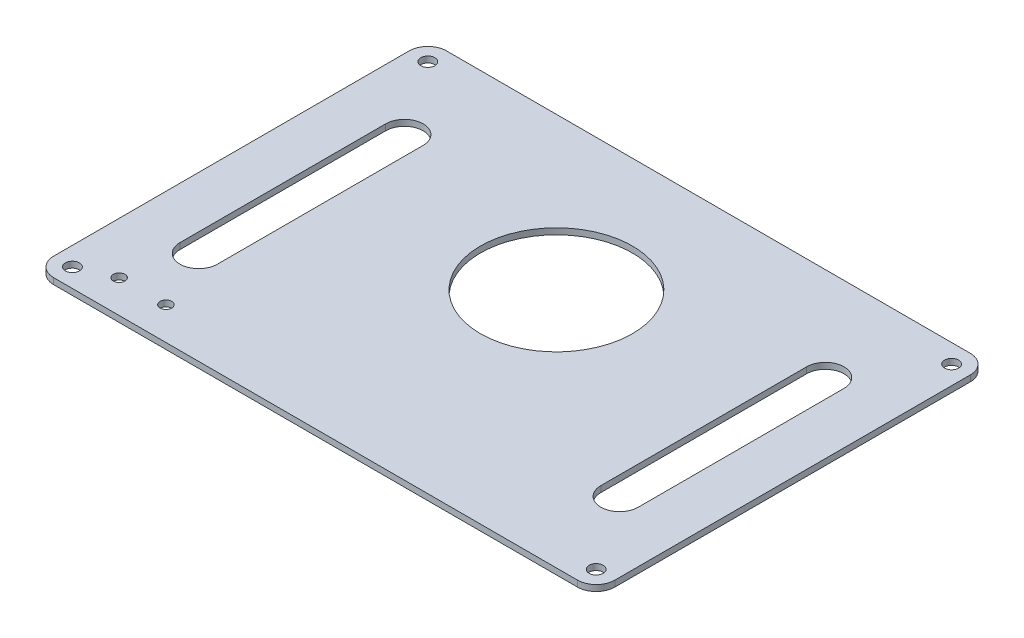
ISO-10303-21;
HEADER;
FILE_DESCRIPTION(('STEP AP214'),'2;1');
FILE_NAME('part.step','',(''),(''),'','','');
FILE_SCHEMA(('AUTOMOTIVE_DESIGN { 1 0 10303 214 1 1 1 1 }'));
ENDSEC;
DATA;
#1=APPLICATION_CONTEXT('core data for automotive mechanical design processes');
#2=APPLICATION_PROTOCOL_DEFINITION('international standard','automotive_design',2000,#1);
#3=PRODUCT_CONTEXT('',#1,'mechanical');
#4=PRODUCT('Part','Part','',(#3));
#5=PRODUCT_RELATED_PRODUCT_CATEGORY('part','',(#4));
#6=PRODUCT_DEFINITION_FORMATION('','',#4);
#7=PRODUCT_DEFINITION_CONTEXT('part definition',#1,'design');
#8=PRODUCT_DEFINITION('design','',#6,#7);
#9=PRODUCT_DEFINITION_SHAPE('','',#8);
#10=(LENGTH_UNIT() NAMED_UNIT(*) SI_UNIT(.MILLI.,.METRE.));
#11=(NAMED_UNIT(*) PLANE_ANGLE_UNIT() SI_UNIT($,.RADIAN.));
#12=(NAMED_UNIT(*) SI_UNIT($,.STERADIAN.) SOLID_ANGLE_UNIT());
#13=UNCERTAINTY_MEASURE_WITH_UNIT(LENGTH_MEASURE(1.E-05),#10,'distance_accuracy_value','');
#14=(GEOMETRIC_REPRESENTATION_CONTEXT(3) GLOBAL_UNCERTAINTY_ASSIGNED_CONTEXT((#13)) GLOBAL_UNIT_ASSIGNED_CONTEXT((#10,
#11,#12)) REPRESENTATION_CONTEXT('',''));
#15=CARTESIAN_POINT('',(0.,0.,0.));
#16=DIRECTION('',(0.,0.,1.));
#17=DIRECTION('',(1.,0.,0.));
#18=AXIS2_PLACEMENT_3D('',#15,#16,#17);
#19=CARTESIAN_POINT('',(56.0000000000008,1.3,38.));
#20=DIRECTION('',(0.,1.,0.));
#21=DIRECTION('',(0.,0.,1.));
#22=AXIS2_PLACEMENT_3D('',#19,#20,#21);
#23=PLANE('',#22);
#24=CARTESIAN_POINT('',(-39.,1.3,35.0000000000004));
#25=DIRECTION('',(0.,1.,0.));
#26=DIRECTION('',(0.,0.,1.));
#27=AXIS2_PLACEMENT_3D('',#24,#25,#26);
#28=CIRCLE('',#27,1.25);
#29=CARTESIAN_POINT('',(-39.,1.3,36.2500000000004));
#30=VERTEX_POINT('',#29);
#31=EDGE_CURVE('E258',#30,#30,#28,.T.);
#32=ORIENTED_EDGE('',*,*,#31,.F.);
#33=EDGE_LOOP('',(#32));
#34=FACE_BOUND('',#33,.T.);
#35=CARTESIAN_POINT('',(-49.,1.3,35.0000000000004));
#36=DIRECTION('',(0.,1.,0.));
#37=DIRECTION('',(0.,0.,1.));
#38=AXIS2_PLACEMENT_3D('',#35,#36,#37);
#39=CIRCLE('',#38,1.25);
#40=CARTESIAN_POINT('',(-49.,1.3,36.2500000000004));
#41=VERTEX_POINT('',#40);
#42=EDGE_CURVE('E250',#41,#41,#39,.T.);
#43=ORIENTED_EDGE('',*,*,#42,.F.);
#44=EDGE_LOOP('',(#43));
#45=FACE_BOUND('',#44,.T.);
#46=CARTESIAN_POINT('',(45.0000000000001,1.3,-22.000000000001));
#47=DIRECTION('',(0.,1.,0.));
#48=DIRECTION('',(0.,0.,-1.));
#49=AXIS2_PLACEMENT_3D('',#46,#47,#48);
#50=CIRCLE('',#49,4.);
#51=CARTESIAN_POINT('',(49.0000000000001,1.3,-22.0000000000011));
#52=VERTEX_POINT('',#51);
#53=CARTESIAN_POINT('',(41.0000000000001,1.3,-22.0000000000009));
#54=VERTEX_POINT('',#53);
#55=EDGE_CURVE('E54',#52,#54,#50,.T.);
#56=ORIENTED_EDGE('',*,*,#55,.F.);
#57=DIRECTION('',(0.,0.,-1.));
#58=VECTOR('',#57,1.);
#59=CARTESIAN_POINT('',(49.0000000000001,1.3,-22.0000000000011));
#60=LINE('',#59,#58);
#61=CARTESIAN_POINT('',(49.,1.3,22.0000000000004));
#62=VERTEX_POINT('',#61);
#63=EDGE_CURVE('E210',#62,#52,#60,.T.);
#64=ORIENTED_EDGE('',*,*,#63,.F.);
#65=CARTESIAN_POINT('',(45.,1.3,22.0000000000004));
#66=DIRECTION('',(0.,1.,0.));
#67=DIRECTION('',(0.,0.,-1.));
#68=AXIS2_PLACEMENT_3D('',#65,#66,#67);
#69=CIRCLE('',#68,4.);
#70=CARTESIAN_POINT('',(41.,1.3,22.0000000000004));
#71=VERTEX_POINT('',#70);
#72=EDGE_CURVE('E230',#71,#62,#69,.T.);
#73=ORIENTED_EDGE('',*,*,#72,.F.);
#74=DIRECTION('',(0.,0.,1.));
#75=VECTOR('',#74,1.);
#76=CARTESIAN_POINT('',(41.0000000000001,1.3,-22.0000000000009));
#77=LINE('',#76,#75);
#78=EDGE_CURVE('E225',#54,#71,#77,.T.);
#79=ORIENTED_EDGE('',*,*,#78,.F.);
#80=EDGE_LOOP('',(#56,#64,#73,#79));
#81=FACE_BOUND('',#80,.T.);
#82=CARTESIAN_POINT('',(-45.,1.3,-22.));
#83=DIRECTION('',(0.,1.,0.));
#84=DIRECTION('',(0.,0.,1.));
#85=AXIS2_PLACEMENT_3D('',#82,#83,#84);
#86=CIRCLE('',#85,4.);
#87=CARTESIAN_POINT('',(-41.,1.3,-22.));
#88=VERTEX_POINT('',#87);
#89=CARTESIAN_POINT('',(-49.,1.3,-22.));
#90=VERTEX_POINT('',#89);
#91=EDGE_CURVE('E62',#88,#90,#86,.T.);
#92=ORIENTED_EDGE('',*,*,#91,.F.);
#93=DIRECTION('',(0.,0.,-1.));
#94=VECTOR('',#93,1.);
#95=CARTESIAN_POINT('',(-41.,1.3,-22.));
#96=LINE('',#95,#94);
#97=CARTESIAN_POINT('',(-41.,1.3,22.0000000000004));
#98=VERTEX_POINT('',#97);
#99=EDGE_CURVE('E176',#98,#88,#96,.T.);
#100=ORIENTED_EDGE('',*,*,#99,.F.);
#101=CARTESIAN_POINT('',(-45.,1.3,22.0000000000004));
#102=DIRECTION('',(0.,1.,0.));
#103=DIRECTION('',(0.,0.,1.));
#104=AXIS2_PLACEMENT_3D('',#101,#102,#103);
#105=CIRCLE('',#104,4.);
#106=CARTESIAN_POINT('',(-49.,1.3,22.0000000000004));
#107=VERTEX_POINT('',#106);
#108=EDGE_CURVE('E180',#107,#98,#105,.T.);
#109=ORIENTED_EDGE('',*,*,#108,.F.);
#110=DIRECTION('',(0.,0.,1.));
#111=VECTOR('',#110,1.);
#112=CARTESIAN_POINT('',(-49.,1.3,-22.));
#113=LINE('',#112,#111);
#114=EDGE_CURVE('E189',#90,#107,#113,.T.);
#115=ORIENTED_EDGE('',*,*,#114,.F.);
#116=EDGE_LOOP('',(#92,#100,#109,#115));
#117=FACE_BOUND('',#116,.T.);
#118=CARTESIAN_POINT('',(0.,1.3,-9.49999999999999));
#119=DIRECTION('',(0.,1.,0.));
#120=DIRECTION('',(0.,0.,1.));
#121=AXIS2_PLACEMENT_3D('',#118,#119,#120);
#122=CIRCLE('',#121,16.25);
#123=CARTESIAN_POINT('',(0.,1.3,6.75000000000001));
#124=VERTEX_POINT('',#123);
#125=EDGE_CURVE('E199',#124,#124,#122,.T.);
#126=ORIENTED_EDGE('',*,*,#125,.F.);
#127=EDGE_LOOP('',(#126));
#128=FACE_BOUND('',#127,.T.);
#129=CARTESIAN_POINT('',(56.0000000000008,1.3,38.));
#130=DIRECTION('',(0.,1.,0.));
#131=DIRECTION('',(0.,0.,1.));
#132=AXIS2_PLACEMENT_3D('',#129,#130,#131);
#133=CIRCLE('',#132,1.5);
#134=CARTESIAN_POINT('',(56.0000000000008,1.3,39.5));
#135=VERTEX_POINT('',#134);
#136=EDGE_CURVE('E278',#135,#135,#133,.T.);
#137=ORIENTED_EDGE('',*,*,#136,.F.);
#138=EDGE_LOOP('',(#137));
#139=FACE_BOUND('',#138,.T.);
#140=CARTESIAN_POINT('',(-56.,1.3,-38.));
#141=DIRECTION('',(0.,1.,0.));
#142=DIRECTION('',(0.,0.,1.));
#143=AXIS2_PLACEMENT_3D('',#140,#141,#142);
#144=CIRCLE('',#143,1.5);
#145=CARTESIAN_POINT('',(-56.,1.3,-36.5));
#146=VERTEX_POINT('',#145);
#147=EDGE_CURVE('E294',#146,#146,#144,.T.);
#148=ORIENTED_EDGE('',*,*,#147,.F.);
#149=EDGE_LOOP('',(#148));
#150=FACE_BOUND('',#149,.T.);
#151=CARTESIAN_POINT('',(56.0000000000008,1.3,38.));
#152=DIRECTION('',(0.,1.,0.));
#153=DIRECTION('',(0.,0.,1.));
#154=AXIS2_PLACEMENT_3D('',#151,#152,#153);
#155=CIRCLE('',#154,3.9999999999996);
#156=CARTESIAN_POINT('',(56.0000000000008,1.3,42.));
#157=VERTEX_POINT('',#156);
#158=CARTESIAN_POINT('',(60.,1.3,38.));
#159=VERTEX_POINT('',#158);
#160=EDGE_CURVE('E302',#157,#159,#155,.T.);
#161=ORIENTED_EDGE('',*,*,#160,.T.);
#162=DIRECTION('',(0.,0.,-1.));
#163=VECTOR('',#162,1.);
#164=CARTESIAN_POINT('',(60.,1.3,38.));
#165=LINE('',#164,#163);
#166=CARTESIAN_POINT('',(60.,1.3,-38.));
#167=VERTEX_POINT('',#166);
#168=EDGE_CURVE('E306',#159,#167,#165,.T.);
#169=ORIENTED_EDGE('',*,*,#168,.T.);
#170=CARTESIAN_POINT('',(56.,1.3,-38.));
#171=DIRECTION('',(0.,1.,0.));
#172=DIRECTION('',(0.,0.,1.));
#173=AXIS2_PLACEMENT_3D('',#170,#171,#172);
#174=CIRCLE('',#173,4.);
#175=CARTESIAN_POINT('',(56.,1.3,-42.));
#176=VERTEX_POINT('',#175);
#177=EDGE_CURVE('E310',#167,#176,#174,.T.);
#178=ORIENTED_EDGE('',*,*,#177,.T.);
#179=DIRECTION('',(-1.,0.,0.));
#180=VECTOR('',#179,1.);
#181=CARTESIAN_POINT('',(-56.,1.3,-42.));
#182=LINE('',#181,#180);
#183=CARTESIAN_POINT('',(-56.,1.3,-42.));
#184=VERTEX_POINT('',#183);
#185=EDGE_CURVE('E313',#176,#184,#182,.T.);
#186=ORIENTED_EDGE('',*,*,#185,.T.);
#187=CARTESIAN_POINT('',(-56.,1.3,-38.));
#188=DIRECTION('',(0.,1.,0.));
#189=DIRECTION('',(0.,0.,1.));
#190=AXIS2_PLACEMENT_3D('',#187,#188,#189);
#191=CIRCLE('',#190,4.);
#192=CARTESIAN_POINT('',(-60.,1.3,-38.));
#193=VERTEX_POINT('',#192);
#194=EDGE_CURVE('E316',#184,#193,#191,.T.);
#195=ORIENTED_EDGE('',*,*,#194,.T.);
#196=DIRECTION('',(0.,0.,1.));
#197=VECTOR('',#196,1.);
#198=CARTESIAN_POINT('',(-60.,1.3,38.));
#199=LINE('',#198,#197);
#200=CARTESIAN_POINT('',(-60.,1.3,38.));
#201=VERTEX_POINT('',#200);
#202=EDGE_CURVE('E319',#193,#201,#199,.T.);
#203=ORIENTED_EDGE('',*,*,#202,.T.);
#204=CARTESIAN_POINT('',(-55.9999999999992,1.3,38.));
#205=DIRECTION('',(0.,1.,0.));
#206=DIRECTION('',(0.,0.,1.));
#207=AXIS2_PLACEMENT_3D('',#204,#205,#206);
#208=CIRCLE('',#207,4.0000000000004);
#209=CARTESIAN_POINT('',(-55.9999999999992,1.3,42.0000000000004));
#210=VERTEX_POINT('',#209);
#211=EDGE_CURVE('E322',#201,#210,#208,.T.);
#212=ORIENTED_EDGE('',*,*,#211,.T.);
#213=DIRECTION('',(1.,0.,0.));
#214=VECTOR('',#213,1.);
#215=CARTESIAN_POINT('',(-55.9999999999992,1.3,42.));
#216=LINE('',#215,#214);
#217=EDGE_CURVE('E325',#210,#157,#216,.T.);
#218=ORIENTED_EDGE('',*,*,#217,.T.);
#219=EDGE_LOOP('',(#161,#169,#178,#186,#195,#203,#212,#218));
#220=FACE_BOUND('',#219,.T.);
#221=CARTESIAN_POINT('',(56.,1.3,-38.));
#222=DIRECTION('',(0.,1.,0.));
#223=DIRECTION('',(0.,0.,1.));
#224=AXIS2_PLACEMENT_3D('',#221,#222,#223);
#225=CIRCLE('',#224,1.5);
#226=CARTESIAN_POINT('',(56.,1.3,-36.5));
#227=VERTEX_POINT('',#226);
#228=EDGE_CURVE('E286',#227,#227,#225,.T.);
#229=ORIENTED_EDGE('',*,*,#228,.F.);
#230=EDGE_LOOP('',(#229));
#231=FACE_BOUND('',#230,.T.);
#232=CARTESIAN_POINT('',(-55.9999999999992,1.3,38.));
#233=DIRECTION('',(0.,1.,0.));
#234=DIRECTION('',(0.,0.,1.));
#235=AXIS2_PLACEMENT_3D('',#232,#233,#234);
#236=CIRCLE('',#235,1.5);
#237=CARTESIAN_POINT('',(-55.9999999999992,1.3,39.5));
#238=VERTEX_POINT('',#237);
#239=EDGE_CURVE('E270',#238,#238,#236,.T.);
#240=ORIENTED_EDGE('',*,*,#239,.F.);
#241=EDGE_LOOP('',(#240));
#242=FACE_BOUND('',#241,.T.);
#243=ADVANCED_FACE('F38',(#34,#45,#81,#117,#128,#139,#150,#220,#231,#242),#23,.T.);
#244=CARTESIAN_POINT('',(56.0000000000008,0.,38.));
#245=DIRECTION('',(0.,1.,0.));
#246=DIRECTION('',(0.,0.,1.));
#247=AXIS2_PLACEMENT_3D('',#244,#245,#246);
#248=PLANE('',#247);
#249=CARTESIAN_POINT('',(-39.,0.,35.0000000000004));
#250=DIRECTION('',(0.,1.,0.));
#251=DIRECTION('',(0.,0.,1.));
#252=AXIS2_PLACEMENT_3D('',#249,#250,#251);
#253=CIRCLE('',#252,1.25);
#254=CARTESIAN_POINT('',(-39.,0.,36.2500000000004));
#255=VERTEX_POINT('',#254);
#256=EDGE_CURVE('E254',#255,#255,#253,.T.);
#257=ORIENTED_EDGE('',*,*,#256,.T.);
#258=EDGE_LOOP('',(#257));
#259=FACE_BOUND('',#258,.T.);
#260=CARTESIAN_POINT('',(-49.,0.,35.0000000000004));
#261=DIRECTION('',(0.,1.,0.));
#262=DIRECTION('',(0.,0.,1.));
#263=AXIS2_PLACEMENT_3D('',#260,#261,#262);
#264=CIRCLE('',#263,1.25);
#265=CARTESIAN_POINT('',(-49.,0.,36.2500000000004));
#266=VERTEX_POINT('',#265);
#267=EDGE_CURVE('E226',#266,#266,#264,.T.);
#268=ORIENTED_EDGE('',*,*,#267,.T.);
#269=EDGE_LOOP('',(#268));
#270=FACE_BOUND('',#269,.T.);
#271=DIRECTION('',(0.,0.,-1.));
#272=VECTOR('',#271,1.);
#273=CARTESIAN_POINT('',(49.0000000000001,0.,-22.0000000000011));
#274=LINE('',#273,#272);
#275=CARTESIAN_POINT('',(49.,0.,22.0000000000004));
#276=VERTEX_POINT('',#275);
#277=CARTESIAN_POINT('',(49.0000000000001,0.,-22.0000000000011));
#278=VERTEX_POINT('',#277);
#279=EDGE_CURVE('E218',#276,#278,#274,.T.);
#280=ORIENTED_EDGE('',*,*,#279,.T.);
#281=CARTESIAN_POINT('',(45.0000000000001,0.,-22.000000000001));
#282=DIRECTION('',(0.,1.,0.));
#283=DIRECTION('',(0.,0.,-1.));
#284=AXIS2_PLACEMENT_3D('',#281,#282,#283);
#285=CIRCLE('',#284,4.);
#286=CARTESIAN_POINT('',(41.0000000000001,0.,-22.0000000000009));
#287=VERTEX_POINT('',#286);
#288=EDGE_CURVE('E205',#278,#287,#285,.T.);
#289=ORIENTED_EDGE('',*,*,#288,.T.);
#290=DIRECTION('',(0.,0.,1.));
#291=VECTOR('',#290,1.);
#292=CARTESIAN_POINT('',(41.0000000000001,0.,-22.0000000000009));
#293=LINE('',#292,#291);
#294=CARTESIAN_POINT('',(41.,0.,22.0000000000004));
#295=VERTEX_POINT('',#294);
#296=EDGE_CURVE('E209',#287,#295,#293,.T.);
#297=ORIENTED_EDGE('',*,*,#296,.T.);
#298=CARTESIAN_POINT('',(45.,0.,22.0000000000004));
#299=DIRECTION('',(0.,1.,0.));
#300=DIRECTION('',(0.,0.,-1.));
#301=AXIS2_PLACEMENT_3D('',#298,#299,#300);
#302=CIRCLE('',#301,4.);
#303=EDGE_CURVE('E214',#295,#276,#302,.T.);
#304=ORIENTED_EDGE('',*,*,#303,.T.);
#305=EDGE_LOOP('',(#280,#289,#297,#304));
#306=FACE_BOUND('',#305,.T.);
#307=DIRECTION('',(0.,0.,-1.));
#308=VECTOR('',#307,1.);
#309=CARTESIAN_POINT('',(-41.,0.,-22.));
#310=LINE('',#309,#308);
#311=CARTESIAN_POINT('',(-41.,0.,22.0000000000004));
#312=VERTEX_POINT('',#311);
#313=CARTESIAN_POINT('',(-41.,0.,-22.));
#314=VERTEX_POINT('',#313);
#315=EDGE_CURVE('E161',#312,#314,#310,.T.);
#316=ORIENTED_EDGE('',*,*,#315,.T.);
#317=CARTESIAN_POINT('',(-45.,0.,-22.));
#318=DIRECTION('',(0.,1.,0.));
#319=DIRECTION('',(0.,0.,1.));
#320=AXIS2_PLACEMENT_3D('',#317,#318,#319);
#321=CIRCLE('',#320,4.);
#322=CARTESIAN_POINT('',(-49.,0.,-22.));
#323=VERTEX_POINT('',#322);
#324=EDGE_CURVE('E154',#314,#323,#321,.T.);
#325=ORIENTED_EDGE('',*,*,#324,.T.);
#326=DIRECTION('',(0.,0.,1.));
#327=VECTOR('',#326,1.);
#328=CARTESIAN_POINT('',(-49.,0.,-22.));
#329=LINE('',#328,#327);
#330=CARTESIAN_POINT('',(-49.,0.,22.0000000000004));
#331=VERTEX_POINT('',#330);
#332=EDGE_CURVE('E165',#323,#331,#329,.T.);
#333=ORIENTED_EDGE('',*,*,#332,.T.);
#334=CARTESIAN_POINT('',(-45.,0.,22.0000000000004));
#335=DIRECTION('',(0.,1.,0.));
#336=DIRECTION('',(0.,0.,1.));
#337=AXIS2_PLACEMENT_3D('',#334,#335,#336);
#338=CIRCLE('',#337,4.);
#339=EDGE_CURVE('E170',#331,#312,#338,.T.);
#340=ORIENTED_EDGE('',*,*,#339,.T.);
#341=EDGE_LOOP('',(#316,#325,#333,#340));
#342=FACE_BOUND('',#341,.T.);
#343=CARTESIAN_POINT('',(0.,0.,-9.49999999999999));
#344=DIRECTION('',(0.,1.,0.));
#345=DIRECTION('',(0.,0.,1.));
#346=AXIS2_PLACEMENT_3D('',#343,#344,#345);
#347=CIRCLE('',#346,16.25);
#348=CARTESIAN_POINT('',(0.,0.,6.75000000000001));
#349=VERTEX_POINT('',#348);
#350=EDGE_CURVE('E262',#349,#349,#347,.T.);
#351=ORIENTED_EDGE('',*,*,#350,.T.);
#352=EDGE_LOOP('',(#351));
#353=FACE_BOUND('',#352,.T.);
#354=CARTESIAN_POINT('',(56.0000000000008,0.,38.));
#355=DIRECTION('',(0.,1.,0.));
#356=DIRECTION('',(0.,0.,1.));
#357=AXIS2_PLACEMENT_3D('',#354,#355,#356);
#358=CIRCLE('',#357,3.9999999999996);
#359=CARTESIAN_POINT('',(56.0000000000008,0.,42.));
#360=VERTEX_POINT('',#359);
#361=CARTESIAN_POINT('',(60.,0.,38.));
#362=VERTEX_POINT('',#361);
#363=EDGE_CURVE('E298',#360,#362,#358,.T.);
#364=ORIENTED_EDGE('',*,*,#363,.F.);
#365=DIRECTION('',(1.,0.,0.));
#366=VECTOR('',#365,1.);
#367=CARTESIAN_POINT('',(-55.9999999999992,0.,42.));
#368=LINE('',#367,#366);
#369=CARTESIAN_POINT('',(-55.9999999999992,0.,42.0000000000004));
#370=VERTEX_POINT('',#369);
#371=EDGE_CURVE('E307',#370,#360,#368,.T.);
#372=ORIENTED_EDGE('',*,*,#371,.F.);
#373=CARTESIAN_POINT('',(-55.9999999999992,0.,38.));
#374=DIRECTION('',(0.,1.,0.));
#375=DIRECTION('',(0.,0.,1.));
#376=AXIS2_PLACEMENT_3D('',#373,#374,#375);
#377=CIRCLE('',#376,4.0000000000004);
#378=CARTESIAN_POINT('',(-60.,0.,38.));
#379=VERTEX_POINT('',#378);
#380=EDGE_CURVE('E347',#379,#370,#377,.T.);
#381=ORIENTED_EDGE('',*,*,#380,.F.);
#382=DIRECTION('',(0.,0.,1.));
#383=VECTOR('',#382,1.);
#384=CARTESIAN_POINT('',(-60.,0.,38.));
#385=LINE('',#384,#383);
#386=CARTESIAN_POINT('',(-60.,0.,-38.));
#387=VERTEX_POINT('',#386);
#388=EDGE_CURVE('E344',#387,#379,#385,.T.);
#389=ORIENTED_EDGE('',*,*,#388,.F.);
#390=CARTESIAN_POINT('',(-56.,0.,-38.));
#391=DIRECTION('',(0.,1.,0.));
#392=DIRECTION('',(0.,0.,1.));
#393=AXIS2_PLACEMENT_3D('',#390,#391,#392);
#394=CIRCLE('',#393,4.);
#395=CARTESIAN_POINT('',(-56.,0.,-42.));
#396=VERTEX_POINT('',#395);
#397=EDGE_CURVE('E341',#396,#387,#394,.T.);
#398=ORIENTED_EDGE('',*,*,#397,.F.);
#399=DIRECTION('',(-1.,0.,0.));
#400=VECTOR('',#399,1.);
#401=CARTESIAN_POINT('',(-56.,0.,-42.));
#402=LINE('',#401,#400);
#403=CARTESIAN_POINT('',(56.,0.,-42.));
#404=VERTEX_POINT('',#403);
#405=EDGE_CURVE('E338',#404,#396,#402,.T.);
#406=ORIENTED_EDGE('',*,*,#405,.F.);
#407=CARTESIAN_POINT('',(56.,0.,-38.));
#408=DIRECTION('',(0.,1.,0.));
#409=DIRECTION('',(0.,0.,1.));
#410=AXIS2_PLACEMENT_3D('',#407,#408,#409);
#411=CIRCLE('',#410,4.);
#412=CARTESIAN_POINT('',(60.,0.,-38.));
#413=VERTEX_POINT('',#412);
#414=EDGE_CURVE('E335',#413,#404,#411,.T.);
#415=ORIENTED_EDGE('',*,*,#414,.F.);
#416=DIRECTION('',(0.,0.,-1.));
#417=VECTOR('',#416,1.);
#418=CARTESIAN_POINT('',(60.,0.,38.));
#419=LINE('',#418,#417);
#420=EDGE_CURVE('E332',#362,#413,#419,.T.);
#421=ORIENTED_EDGE('',*,*,#420,.F.);
#422=EDGE_LOOP('',(#364,#372,#381,#389,#398,#406,#415,#421));
#423=FACE_BOUND('',#422,.T.);
#424=CARTESIAN_POINT('',(-56.,0.,-38.));
#425=DIRECTION('',(0.,1.,0.));
#426=DIRECTION('',(0.,0.,1.));
#427=AXIS2_PLACEMENT_3D('',#424,#425,#426);
#428=CIRCLE('',#427,1.5);
#429=CARTESIAN_POINT('',(-56.,0.,-36.5));
#430=VERTEX_POINT('',#429);
#431=EDGE_CURVE('E290',#430,#430,#428,.T.);
#432=ORIENTED_EDGE('',*,*,#431,.T.);
#433=EDGE_LOOP('',(#432));
#434=FACE_BOUND('',#433,.T.);
#435=CARTESIAN_POINT('',(56.,0.,-38.));
#436=DIRECTION('',(0.,1.,0.));
#437=DIRECTION('',(0.,0.,1.));
#438=AXIS2_PLACEMENT_3D('',#435,#436,#437);
#439=CIRCLE('',#438,1.5);
#440=CARTESIAN_POINT('',(56.,0.,-36.5));
#441=VERTEX_POINT('',#440);
#442=EDGE_CURVE('E282',#441,#441,#439,.T.);
#443=ORIENTED_EDGE('',*,*,#442,.T.);
#444=EDGE_LOOP('',(#443));
#445=FACE_BOUND('',#444,.T.);
#446=CARTESIAN_POINT('',(56.0000000000008,0.,38.));
#447=DIRECTION('',(0.,1.,0.));
#448=DIRECTION('',(0.,0.,1.));
#449=AXIS2_PLACEMENT_3D('',#446,#447,#448);
#450=CIRCLE('',#449,1.5);
#451=CARTESIAN_POINT('',(56.0000000000008,0.,39.5));
#452=VERTEX_POINT('',#451);
#453=EDGE_CURVE('E274',#452,#452,#450,.T.);
#454=ORIENTED_EDGE('',*,*,#453,.T.);
#455=EDGE_LOOP('',(#454));
#456=FACE_BOUND('',#455,.T.);
#457=CARTESIAN_POINT('',(-55.9999999999992,0.,38.));
#458=DIRECTION('',(0.,1.,0.));
#459=DIRECTION('',(0.,0.,1.));
#460=AXIS2_PLACEMENT_3D('',#457,#458,#459);
#461=CIRCLE('',#460,1.5);
#462=CARTESIAN_POINT('',(-55.9999999999992,0.,39.5));
#463=VERTEX_POINT('',#462);
#464=EDGE_CURVE('E266',#463,#463,#461,.T.);
#465=ORIENTED_EDGE('',*,*,#464,.T.);
#466=EDGE_LOOP('',(#465));
#467=FACE_BOUND('',#466,.T.);
#468=ADVANCED_FACE('F172',(#259,#270,#306,#342,#353,#423,#434,#445,#456,#467),#248,.F.);
#469=CARTESIAN_POINT('',(56.0000000000008,1.3,38.));
#470=DIRECTION('',(0.,-1.,0.));
#471=DIRECTION('',(0.,0.,-1.));
#472=AXIS2_PLACEMENT_3D('',#469,#470,#471);
#473=CYLINDRICAL_SURFACE('',#472,3.9999999999996);
#474=ORIENTED_EDGE('',*,*,#363,.T.);
#475=DIRECTION('',(0.,-1.,0.));
#476=VECTOR('',#475,1.);
#477=CARTESIAN_POINT('',(60.,1.3,38.));
#478=LINE('',#477,#476);
#479=EDGE_CURVE('E11',#159,#362,#478,.T.);
#480=ORIENTED_EDGE('',*,*,#479,.F.);
#481=ORIENTED_EDGE('',*,*,#160,.F.);
#482=DIRECTION('',(0.,-1.,0.));
#483=VECTOR('',#482,1.);
#484=CARTESIAN_POINT('',(56.0000000000008,1.3,42.));
#485=LINE('',#484,#483);
#486=EDGE_CURVE('E328',#157,#360,#485,.T.);
#487=ORIENTED_EDGE('',*,*,#486,.T.);
#488=EDGE_LOOP('',(#474,#480,#481,#487));
#489=FACE_BOUND('',#488,.T.);
#490=ADVANCED_FACE('F40',(#489),#473,.T.);
#491=CARTESIAN_POINT('',(60.,1.3,38.));
#492=DIRECTION('',(-1.,0.,0.));
#493=DIRECTION('',(0.,0.,1.));
#494=AXIS2_PLACEMENT_3D('',#491,#492,#493);
#495=PLANE('',#494);
#496=ORIENTED_EDGE('',*,*,#420,.T.);
#497=DIRECTION('',(0.,-1.,0.));
#498=VECTOR('',#497,1.);
#499=CARTESIAN_POINT('',(60.,1.3,-38.));
#500=LINE('',#499,#498);
#501=EDGE_CURVE('E47',#167,#413,#500,.T.);
#502=ORIENTED_EDGE('',*,*,#501,.F.);
#503=ORIENTED_EDGE('',*,*,#168,.F.);
#504=ORIENTED_EDGE('',*,*,#479,.T.);
#505=EDGE_LOOP('',(#496,#502,#503,#504));
#506=FACE_BOUND('',#505,.T.);
#507=ADVANCED_FACE('F403',(#506),#495,.F.);
#508=CARTESIAN_POINT('',(56.,1.3,-38.));
#509=DIRECTION('',(0.,-1.,0.));
#510=DIRECTION('',(0.,0.,-1.));
#511=AXIS2_PLACEMENT_3D('',#508,#509,#510);
#512=CYLINDRICAL_SURFACE('',#511,4.);
#513=ORIENTED_EDGE('',*,*,#414,.T.);
#514=DIRECTION('',(0.,-1.,0.));
#515=VECTOR('',#514,1.);
#516=CARTESIAN_POINT('',(56.,1.3,-42.));
#517=LINE('',#516,#515);
#518=EDGE_CURVE('E371',#176,#404,#517,.T.);
#519=ORIENTED_EDGE('',*,*,#518,.F.);
#520=ORIENTED_EDGE('',*,*,#177,.F.);
#521=ORIENTED_EDGE('',*,*,#501,.T.);
#522=EDGE_LOOP('',(#513,#519,#520,#521));
#523=FACE_BOUND('',#522,.T.);
#524=ADVANCED_FACE('F380',(#523),#512,.T.);
#525=CARTESIAN_POINT('',(-56.,1.3,-42.));
#526=DIRECTION('',(0.,0.,1.));
#527=DIRECTION('',(1.,0.,0.));
#528=AXIS2_PLACEMENT_3D('',#525,#526,#527);
#529=PLANE('',#528);
#530=ORIENTED_EDGE('',*,*,#405,.T.);
#531=DIRECTION('',(0.,-1.,0.));
#532=VECTOR('',#531,1.);
#533=CARTESIAN_POINT('',(-56.,1.3,-42.));
#534=LINE('',#533,#532);
#535=EDGE_CURVE('E367',#184,#396,#534,.T.);
#536=ORIENTED_EDGE('',*,*,#535,.F.);
#537=ORIENTED_EDGE('',*,*,#185,.F.);
#538=ORIENTED_EDGE('',*,*,#518,.T.);
#539=EDGE_LOOP('',(#530,#536,#537,#538));
#540=FACE_BOUND('',#539,.T.);
#541=ADVANCED_FACE('F391',(#540),#529,.F.);
#542=CARTESIAN_POINT('',(-56.,1.3,-38.));
#543=DIRECTION('',(0.,-1.,0.));
#544=DIRECTION('',(0.,0.,-1.));
#545=AXIS2_PLACEMENT_3D('',#542,#543,#544);
#546=CYLINDRICAL_SURFACE('',#545,4.);
#547=ORIENTED_EDGE('',*,*,#397,.T.);
#548=DIRECTION('',(0.,-1.,0.));
#549=VECTOR('',#548,1.);
#550=CARTESIAN_POINT('',(-60.,1.3,-38.));
#551=LINE('',#550,#549);
#552=EDGE_CURVE('E363',#193,#387,#551,.T.);
#553=ORIENTED_EDGE('',*,*,#552,.F.);
#554=ORIENTED_EDGE('',*,*,#194,.F.);
#555=ORIENTED_EDGE('',*,*,#535,.T.);
#556=EDGE_LOOP('',(#547,#553,#554,#555));
#557=FACE_BOUND('',#556,.T.);
#558=ADVANCED_FACE('F395',(#557),#546,.T.);
#559=CARTESIAN_POINT('',(-60.,1.3,38.));
#560=DIRECTION('',(1.,0.,0.));
#561=DIRECTION('',(0.,0.,-1.));
#562=AXIS2_PLACEMENT_3D('',#559,#560,#561);
#563=PLANE('',#562);
#564=ORIENTED_EDGE('',*,*,#388,.T.);
#565=DIRECTION('',(0.,-1.,0.));
#566=VECTOR('',#565,1.);
#567=CARTESIAN_POINT('',(-60.,1.3,38.));
#568=LINE('',#567,#566);
#569=EDGE_CURVE('E359',#201,#379,#568,.T.);
#570=ORIENTED_EDGE('',*,*,#569,.F.);
#571=ORIENTED_EDGE('',*,*,#202,.F.);
#572=ORIENTED_EDGE('',*,*,#552,.T.);
#573=EDGE_LOOP('',(#564,#570,#571,#572));
#574=FACE_BOUND('',#573,.T.);
#575=ADVANCED_FACE('F416',(#574),#563,.F.);
#576=CARTESIAN_POINT('',(-55.9999999999992,1.3,38.));
#577=DIRECTION('',(0.,-1.,0.));
#578=DIRECTION('',(0.,0.,-1.));
#579=AXIS2_PLACEMENT_3D('',#576,#577,#578);
#580=CYLINDRICAL_SURFACE('',#579,4.0000000000004);
#581=ORIENTED_EDGE('',*,*,#380,.T.);
#582=DIRECTION('',(0.,-1.,0.));
#583=VECTOR('',#582,1.);
#584=CARTESIAN_POINT('',(-55.9999999999992,1.3,42.0000000000004));
#585=LINE('',#584,#583);
#586=EDGE_CURVE('E355',#210,#370,#585,.T.);
#587=ORIENTED_EDGE('',*,*,#586,.F.);
#588=ORIENTED_EDGE('',*,*,#211,.F.);
#589=ORIENTED_EDGE('',*,*,#569,.T.);
#590=EDGE_LOOP('',(#581,#587,#588,#589));
#591=FACE_BOUND('',#590,.T.);
#592=ADVANCED_FACE('F414',(#591),#580,.T.);
#593=CARTESIAN_POINT('',(-55.9999999999992,1.3,42.));
#594=DIRECTION('',(0.,0.,-1.));
#595=DIRECTION('',(-1.,0.,0.));
#596=AXIS2_PLACEMENT_3D('',#593,#594,#595);
#597=PLANE('',#596);
#598=ORIENTED_EDGE('',*,*,#371,.T.);
#599=ORIENTED_EDGE('',*,*,#486,.F.);
#600=ORIENTED_EDGE('',*,*,#217,.F.);
#601=ORIENTED_EDGE('',*,*,#586,.T.);
#602=EDGE_LOOP('',(#598,#599,#600,#601));
#603=FACE_BOUND('',#602,.T.);
#604=ADVANCED_FACE('F409',(#603),#597,.F.);
#605=CARTESIAN_POINT('',(-56.,1.3,-38.));
#606=DIRECTION('',(0.,-1.,0.));
#607=DIRECTION('',(0.,0.,-1.));
#608=AXIS2_PLACEMENT_3D('',#605,#606,#607);
#609=CYLINDRICAL_SURFACE('',#608,1.5);
#610=ORIENTED_EDGE('',*,*,#147,.T.);
#611=EDGE_LOOP('',(#610));
#612=FACE_BOUND('',#611,.T.);
#613=ORIENTED_EDGE('',*,*,#431,.F.);
#614=EDGE_LOOP('',(#613));
#615=FACE_BOUND('',#614,.T.);
#616=ADVANCED_FACE('F437',(#612,#615),#609,.F.);
#617=CARTESIAN_POINT('',(56.,1.3,-38.));
#618=DIRECTION('',(0.,-1.,0.));
#619=DIRECTION('',(0.,0.,-1.));
#620=AXIS2_PLACEMENT_3D('',#617,#618,#619);
#621=CYLINDRICAL_SURFACE('',#620,1.5);
#622=ORIENTED_EDGE('',*,*,#228,.T.);
#623=EDGE_LOOP('',(#622));
#624=FACE_BOUND('',#623,.T.);
#625=ORIENTED_EDGE('',*,*,#442,.F.);
#626=EDGE_LOOP('',(#625));
#627=FACE_BOUND('',#626,.T.);
#628=ADVANCED_FACE('F444',(#624,#627),#621,.F.);
#629=CARTESIAN_POINT('',(56.0000000000008,1.3,38.));
#630=DIRECTION('',(0.,-1.,0.));
#631=DIRECTION('',(0.,0.,-1.));
#632=AXIS2_PLACEMENT_3D('',#629,#630,#631);
#633=CYLINDRICAL_SURFACE('',#632,1.5);
#634=ORIENTED_EDGE('',*,*,#136,.T.);
#635=EDGE_LOOP('',(#634));
#636=FACE_BOUND('',#635,.T.);
#637=ORIENTED_EDGE('',*,*,#453,.F.);
#638=EDGE_LOOP('',(#637));
#639=FACE_BOUND('',#638,.T.);
#640=ADVANCED_FACE('F449',(#636,#639),#633,.F.);
#641=CARTESIAN_POINT('',(-55.9999999999992,1.3,38.));
#642=DIRECTION('',(0.,-1.,0.));
#643=DIRECTION('',(0.,0.,-1.));
#644=AXIS2_PLACEMENT_3D('',#641,#642,#643);
#645=CYLINDRICAL_SURFACE('',#644,1.5);
#646=ORIENTED_EDGE('',*,*,#239,.T.);
#647=EDGE_LOOP('',(#646));
#648=FACE_BOUND('',#647,.T.);
#649=ORIENTED_EDGE('',*,*,#464,.F.);
#650=EDGE_LOOP('',(#649));
#651=FACE_BOUND('',#650,.T.);
#652=ADVANCED_FACE('F461',(#648,#651),#645,.F.);
#653=CARTESIAN_POINT('',(0.,0.,-9.49999999999999));
#654=DIRECTION('',(0.,1.,0.));
#655=DIRECTION('',(0.,0.,1.));
#656=AXIS2_PLACEMENT_3D('',#653,#654,#655);
#657=CYLINDRICAL_SURFACE('',#656,16.25);
#658=ORIENTED_EDGE('',*,*,#350,.F.);
#659=EDGE_LOOP('',(#658));
#660=FACE_BOUND('',#659,.T.);
#661=ORIENTED_EDGE('',*,*,#125,.T.);
#662=EDGE_LOOP('',(#661));
#663=FACE_BOUND('',#662,.T.);
#664=ADVANCED_FACE('F463',(#660,#663),#657,.F.);
#665=CARTESIAN_POINT('',(-45.,0.,-22.));
#666=DIRECTION('',(0.,1.,0.));
#667=DIRECTION('',(0.,0.,1.));
#668=AXIS2_PLACEMENT_3D('',#665,#666,#667);
#669=CYLINDRICAL_SURFACE('',#668,4.);
#670=ORIENTED_EDGE('',*,*,#91,.T.);
#671=DIRECTION('',(0.,1.,0.));
#672=VECTOR('',#671,1.);
#673=CARTESIAN_POINT('',(-49.,0.,-22.));
#674=LINE('',#673,#672);
#675=EDGE_CURVE('E150',#323,#90,#674,.T.);
#676=ORIENTED_EDGE('',*,*,#675,.F.);
#677=ORIENTED_EDGE('',*,*,#324,.F.);
#678=DIRECTION('',(0.,1.,0.));
#679=VECTOR('',#678,1.);
#680=CARTESIAN_POINT('',(-41.,0.,-22.));
#681=LINE('',#680,#679);
#682=EDGE_CURVE('E196',#314,#88,#681,.T.);
#683=ORIENTED_EDGE('',*,*,#682,.T.);
#684=EDGE_LOOP('',(#670,#676,#677,#683));
#685=FACE_BOUND('',#684,.T.);
#686=ADVANCED_FACE('F152',(#685),#669,.F.);
#687=CARTESIAN_POINT('',(-41.,0.,-22.));
#688=DIRECTION('',(1.,0.,0.));
#689=DIRECTION('',(0.,0.,-1.));
#690=AXIS2_PLACEMENT_3D('',#687,#688,#689);
#691=PLANE('',#690);
#692=ORIENTED_EDGE('',*,*,#99,.T.);
#693=ORIENTED_EDGE('',*,*,#682,.F.);
#694=ORIENTED_EDGE('',*,*,#315,.F.);
#695=DIRECTION('',(0.,1.,0.));
#696=VECTOR('',#695,1.);
#697=CARTESIAN_POINT('',(-41.,0.,22.0000000000004));
#698=LINE('',#697,#696);
#699=EDGE_CURVE('E200',#312,#98,#698,.T.);
#700=ORIENTED_EDGE('',*,*,#699,.T.);
#701=EDGE_LOOP('',(#692,#693,#694,#700));
#702=FACE_BOUND('',#701,.T.);
#703=ADVANCED_FACE('F499',(#702),#691,.F.);
#704=CARTESIAN_POINT('',(-45.,0.,22.0000000000004));
#705=DIRECTION('',(0.,1.,0.));
#706=DIRECTION('',(0.,0.,1.));
#707=AXIS2_PLACEMENT_3D('',#704,#705,#706);
#708=CYLINDRICAL_SURFACE('',#707,4.);
#709=ORIENTED_EDGE('',*,*,#108,.T.);
#710=ORIENTED_EDGE('',*,*,#699,.F.);
#711=ORIENTED_EDGE('',*,*,#339,.F.);
#712=DIRECTION('',(0.,1.,0.));
#713=VECTOR('',#712,1.);
#714=CARTESIAN_POINT('',(-49.,0.,22.0000000000004));
#715=LINE('',#714,#713);
#716=EDGE_CURVE('E160',#331,#107,#715,.T.);
#717=ORIENTED_EDGE('',*,*,#716,.T.);
#718=EDGE_LOOP('',(#709,#710,#711,#717));
#719=FACE_BOUND('',#718,.T.);
#720=ADVANCED_FACE('F502',(#719),#708,.F.);
#721=CARTESIAN_POINT('',(-49.,0.,-22.));
#722=DIRECTION('',(-1.,0.,0.));
#723=DIRECTION('',(0.,0.,1.));
#724=AXIS2_PLACEMENT_3D('',#721,#722,#723);
#725=PLANE('',#724);
#726=ORIENTED_EDGE('',*,*,#114,.T.);
#727=ORIENTED_EDGE('',*,*,#716,.F.);
#728=ORIENTED_EDGE('',*,*,#332,.F.);
#729=ORIENTED_EDGE('',*,*,#675,.T.);
#730=EDGE_LOOP('',(#726,#727,#728,#729));
#731=FACE_BOUND('',#730,.T.);
#732=ADVANCED_FACE('F166',(#731),#725,.F.);
#733=CARTESIAN_POINT('',(45.0000000000001,0.,-22.000000000001));
#734=DIRECTION('',(0.,1.,0.));
#735=DIRECTION('',(0.,0.,1.));
#736=AXIS2_PLACEMENT_3D('',#733,#734,#735);
#737=CYLINDRICAL_SURFACE('',#736,4.);
#738=ORIENTED_EDGE('',*,*,#55,.T.);
#739=DIRECTION('',(0.,1.,0.));
#740=VECTOR('',#739,1.);
#741=CARTESIAN_POINT('',(41.0000000000001,0.,-22.0000000000009));
#742=LINE('',#741,#740);
#743=EDGE_CURVE('E222',#287,#54,#742,.T.);
#744=ORIENTED_EDGE('',*,*,#743,.F.);
#745=ORIENTED_EDGE('',*,*,#288,.F.);
#746=DIRECTION('',(0.,1.,0.));
#747=VECTOR('',#746,1.);
#748=CARTESIAN_POINT('',(49.0000000000001,0.,-22.0000000000011));
#749=LINE('',#748,#747);
#750=EDGE_CURVE('E190',#278,#52,#749,.T.);
#751=ORIENTED_EDGE('',*,*,#750,.T.);
#752=EDGE_LOOP('',(#738,#744,#745,#751));
#753=FACE_BOUND('',#752,.T.);
#754=ADVANCED_FACE('F483',(#753),#737,.F.);
#755=CARTESIAN_POINT('',(49.0000000000001,0.,-22.0000000000011));
#756=DIRECTION('',(1.,0.,0.));
#757=DIRECTION('',(0.,0.,-1.));
#758=AXIS2_PLACEMENT_3D('',#755,#756,#757);
#759=PLANE('',#758);
#760=ORIENTED_EDGE('',*,*,#63,.T.);
#761=ORIENTED_EDGE('',*,*,#750,.F.);
#762=ORIENTED_EDGE('',*,*,#279,.F.);
#763=DIRECTION('',(0.,1.,0.));
#764=VECTOR('',#763,1.);
#765=CARTESIAN_POINT('',(49.,0.,22.0000000000004));
#766=LINE('',#765,#764);
#767=EDGE_CURVE('E239',#276,#62,#766,.T.);
#768=ORIENTED_EDGE('',*,*,#767,.T.);
#769=EDGE_LOOP('',(#760,#761,#762,#768));
#770=FACE_BOUND('',#769,.T.);
#771=ADVANCED_FACE('F486',(#770),#759,.F.);
#772=CARTESIAN_POINT('',(45.,0.,22.0000000000004));
#773=DIRECTION('',(0.,1.,0.));
#774=DIRECTION('',(0.,0.,1.));
#775=AXIS2_PLACEMENT_3D('',#772,#773,#774);
#776=CYLINDRICAL_SURFACE('',#775,4.);
#777=ORIENTED_EDGE('',*,*,#72,.T.);
#778=ORIENTED_EDGE('',*,*,#767,.F.);
#779=ORIENTED_EDGE('',*,*,#303,.F.);
#780=DIRECTION('',(0.,1.,0.));
#781=VECTOR('',#780,1.);
#782=CARTESIAN_POINT('',(41.,0.,22.0000000000004));
#783=LINE('',#782,#781);
#784=EDGE_CURVE('E242',#295,#71,#783,.T.);
#785=ORIENTED_EDGE('',*,*,#784,.T.);
#786=EDGE_LOOP('',(#777,#778,#779,#785));
#787=FACE_BOUND('',#786,.T.);
#788=ADVANCED_FACE('F489',(#787),#776,.F.);
#789=CARTESIAN_POINT('',(41.0000000000001,0.,-22.0000000000009));
#790=DIRECTION('',(-1.,0.,0.));
#791=DIRECTION('',(0.,0.,1.));
#792=AXIS2_PLACEMENT_3D('',#789,#790,#791);
#793=PLANE('',#792);
#794=ORIENTED_EDGE('',*,*,#78,.T.);
#795=ORIENTED_EDGE('',*,*,#784,.F.);
#796=ORIENTED_EDGE('',*,*,#296,.F.);
#797=ORIENTED_EDGE('',*,*,#743,.T.);
#798=EDGE_LOOP('',(#794,#795,#796,#797));
#799=FACE_BOUND('',#798,.T.);
#800=ADVANCED_FACE('F481',(#799),#793,.F.);
#801=CARTESIAN_POINT('',(-49.,0.,35.0000000000004));
#802=DIRECTION('',(0.,1.,0.));
#803=DIRECTION('',(0.,0.,1.));
#804=AXIS2_PLACEMENT_3D('',#801,#802,#803);
#805=CYLINDRICAL_SURFACE('',#804,1.25);
#806=ORIENTED_EDGE('',*,*,#267,.F.);
#807=EDGE_LOOP('',(#806));
#808=FACE_BOUND('',#807,.T.);
#809=ORIENTED_EDGE('',*,*,#42,.T.);
#810=EDGE_LOOP('',(#809));
#811=FACE_BOUND('',#810,.T.);
#812=ADVANCED_FACE('F477',(#808,#811),#805,.F.);
#813=CARTESIAN_POINT('',(-39.,0.,35.0000000000004));
#814=DIRECTION('',(0.,1.,0.));
#815=DIRECTION('',(0.,0.,1.));
#816=AXIS2_PLACEMENT_3D('',#813,#814,#815);
#817=CYLINDRICAL_SURFACE('',#816,1.25);
#818=ORIENTED_EDGE('',*,*,#256,.F.);
#819=EDGE_LOOP('',(#818));
#820=FACE_BOUND('',#819,.T.);
#821=ORIENTED_EDGE('',*,*,#31,.T.);
#822=EDGE_LOOP('',(#821));
#823=FACE_BOUND('',#822,.T.);
#824=ADVANCED_FACE('F474',(#820,#823),#817,.F.);
#825=CLOSED_SHELL('',(#243,#468,#490,#507,#524,#541,#558,#575,#592,#604,#616,#628,#640,#652,
#664,#686,#703,#720,#732,#754,#771,#788,#800,#812,#824));
#826=MANIFOLD_SOLID_BREP('B2',#825);
#827=ADVANCED_BREP_SHAPE_REPRESENTATION('',(#18,#826),#14);
#828=SHAPE_DEFINITION_REPRESENTATION(#9,#827);
ENDSEC;
END-ISO-10303-21;
